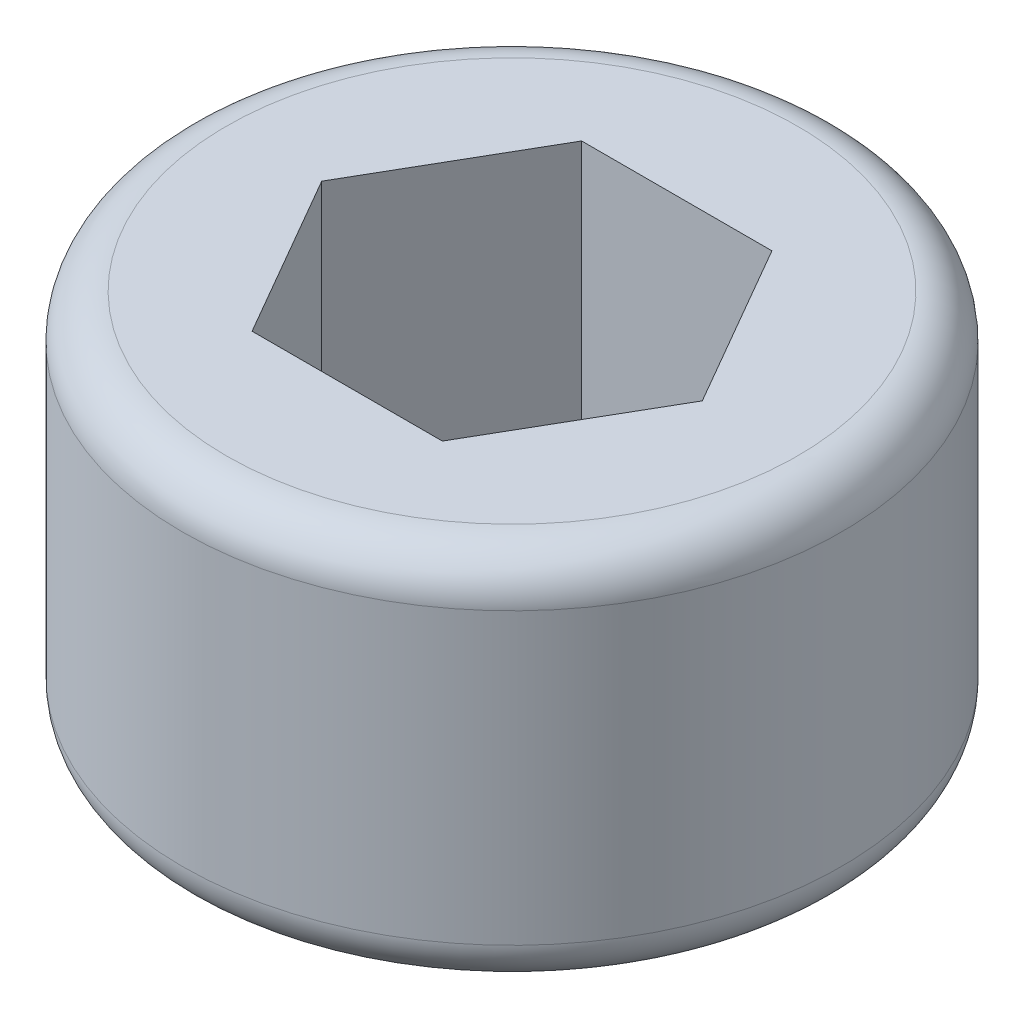
ISO-10303-21;
HEADER;
FILE_DESCRIPTION(('STEP AP214'),'2;1');
FILE_NAME('part.step','',(''),(''),'','','');
FILE_SCHEMA(('AUTOMOTIVE_DESIGN { 1 0 10303 214 1 1 1 1 }'));
ENDSEC;
DATA;
#1=APPLICATION_CONTEXT('core data for automotive mechanical design processes');
#2=APPLICATION_PROTOCOL_DEFINITION('international standard','automotive_design',2000,#1);
#3=PRODUCT_CONTEXT('',#1,'mechanical');
#4=PRODUCT('Part','Part','',(#3));
#5=PRODUCT_RELATED_PRODUCT_CATEGORY('part','',(#4));
#6=PRODUCT_DEFINITION_FORMATION('','',#4);
#7=PRODUCT_DEFINITION_CONTEXT('part definition',#1,'design');
#8=PRODUCT_DEFINITION('design','',#6,#7);
#9=PRODUCT_DEFINITION_SHAPE('','',#8);
#10=(LENGTH_UNIT() NAMED_UNIT(*) SI_UNIT(.MILLI.,.METRE.));
#11=(NAMED_UNIT(*) PLANE_ANGLE_UNIT() SI_UNIT($,.RADIAN.));
#12=(NAMED_UNIT(*) SI_UNIT($,.STERADIAN.) SOLID_ANGLE_UNIT());
#13=UNCERTAINTY_MEASURE_WITH_UNIT(LENGTH_MEASURE(1.E-05),#10,'distance_accuracy_value','');
#14=(GEOMETRIC_REPRESENTATION_CONTEXT(3) GLOBAL_UNCERTAINTY_ASSIGNED_CONTEXT((#13)) GLOBAL_UNIT_ASSIGNED_CONTEXT((#10,
#11,#12)) REPRESENTATION_CONTEXT('',''));
#15=CARTESIAN_POINT('',(0.,0.,0.));
#16=DIRECTION('',(0.,0.,1.));
#17=DIRECTION('',(1.,0.,0.));
#18=AXIS2_PLACEMENT_3D('',#15,#16,#17);
#19=CARTESIAN_POINT('',(0.,2.,0.));
#20=DIRECTION('',(0.,-1.,0.));
#21=DIRECTION('',(0.,0.,-1.));
#22=AXIS2_PLACEMENT_3D('',#19,#20,#21);
#23=CYLINDRICAL_SURFACE('',#22,1.5);
#24=CARTESIAN_POINT('',(0.,1.8,0.));
#25=DIRECTION('',(0.,1.,0.));
#26=DIRECTION('',(0.,0.,1.));
#27=AXIS2_PLACEMENT_3D('',#24,#25,#26);
#28=CIRCLE('',#27,1.5);
#29=CARTESIAN_POINT('',(0.,1.8,1.5));
#30=VERTEX_POINT('',#29);
#31=EDGE_CURVE('E43',#30,#30,#28,.F.);
#32=ORIENTED_EDGE('',*,*,#31,.T.);
#33=EDGE_LOOP('',(#32));
#34=FACE_BOUND('',#33,.T.);
#35=CARTESIAN_POINT('',(0.,0.481495457622373,0.));
#36=DIRECTION('',(0.,-1.,0.));
#37=DIRECTION('',(0.,0.,-1.));
#38=AXIS2_PLACEMENT_3D('',#35,#36,#37);
#39=CIRCLE('',#38,1.5);
#40=CARTESIAN_POINT('',(0.,0.481495457622373,-1.5));
#41=VERTEX_POINT('',#40);
#42=EDGE_CURVE('E146',#41,#41,#39,.F.);
#43=ORIENTED_EDGE('',*,*,#42,.T.);
#44=EDGE_LOOP('',(#43));
#45=FACE_BOUND('',#44,.T.);
#46=ADVANCED_FACE('F35',(#34,#45),#23,.T.);
#47=CARTESIAN_POINT('',(0.,2.,0.));
#48=DIRECTION('',(0.,1.,0.));
#49=DIRECTION('',(0.,0.,1.));
#50=AXIS2_PLACEMENT_3D('',#47,#48,#49);
#51=PLANE('',#50);
#52=CARTESIAN_POINT('',(0.,2.,0.));
#53=DIRECTION('',(0.,1.,0.));
#54=DIRECTION('',(0.,0.,1.));
#55=AXIS2_PLACEMENT_3D('',#52,#53,#54);
#56=CIRCLE('',#55,1.3);
#57=CARTESIAN_POINT('',(0.,2.,1.3));
#58=VERTEX_POINT('',#57);
#59=EDGE_CURVE('E138',#58,#58,#56,.T.);
#60=ORIENTED_EDGE('',*,*,#59,.T.);
#61=EDGE_LOOP('',(#60));
#62=FACE_BOUND('',#61,.T.);
#63=DIRECTION('',(0.5,0.,-0.866025403784439));
#64=VECTOR('',#63,1.);
#65=CARTESIAN_POINT('',(0.433012701892219,2.,0.75));
#66=LINE('',#65,#64);
#67=CARTESIAN_POINT('',(0.433012701892219,2.,0.75));
#68=VERTEX_POINT('',#67);
#69=CARTESIAN_POINT('',(0.866025403784439,2.,0.));
#70=VERTEX_POINT('',#69);
#71=EDGE_CURVE('E50',#68,#70,#66,.T.);
#72=ORIENTED_EDGE('',*,*,#71,.F.);
#73=DIRECTION('',(1.,0.,0.));
#74=VECTOR('',#73,1.);
#75=CARTESIAN_POINT('',(-0.43301270189222,2.,0.75));
#76=LINE('',#75,#74);
#77=CARTESIAN_POINT('',(-0.43301270189222,2.,0.75));
#78=VERTEX_POINT('',#77);
#79=EDGE_CURVE('E134',#78,#68,#76,.T.);
#80=ORIENTED_EDGE('',*,*,#79,.F.);
#81=DIRECTION('',(0.5,0.,0.866025403784439));
#82=VECTOR('',#81,1.);
#83=CARTESIAN_POINT('',(-0.866025403784439,2.,0.));
#84=LINE('',#83,#82);
#85=CARTESIAN_POINT('',(-0.866025403784439,2.,0.));
#86=VERTEX_POINT('',#85);
#87=EDGE_CURVE('E132',#86,#78,#84,.T.);
#88=ORIENTED_EDGE('',*,*,#87,.F.);
#89=DIRECTION('',(-0.5,0.,0.866025403784439));
#90=VECTOR('',#89,1.);
#91=CARTESIAN_POINT('',(-0.433012701892219,2.,-0.75));
#92=LINE('',#91,#90);
#93=CARTESIAN_POINT('',(-0.433012701892219,2.,-0.75));
#94=VERTEX_POINT('',#93);
#95=EDGE_CURVE('E98',#94,#86,#92,.T.);
#96=ORIENTED_EDGE('',*,*,#95,.F.);
#97=DIRECTION('',(-1.,0.,0.));
#98=VECTOR('',#97,1.);
#99=CARTESIAN_POINT('',(0.433012701892219,2.,-0.75));
#100=LINE('',#99,#98);
#101=CARTESIAN_POINT('',(0.433012701892219,2.,-0.75));
#102=VERTEX_POINT('',#101);
#103=EDGE_CURVE('E128',#102,#94,#100,.T.);
#104=ORIENTED_EDGE('',*,*,#103,.F.);
#105=DIRECTION('',(-0.5,0.,-0.866025403784439));
#106=VECTOR('',#105,1.);
#107=CARTESIAN_POINT('',(0.866025403784439,2.,0.));
#108=LINE('',#107,#106);
#109=EDGE_CURVE('E124',#70,#102,#108,.T.);
#110=ORIENTED_EDGE('',*,*,#109,.F.);
#111=EDGE_LOOP('',(#72,#80,#88,#96,#104,#110));
#112=FACE_BOUND('',#111,.T.);
#113=ADVANCED_FACE('F159',(#62,#112),#51,.T.);
#114=CARTESIAN_POINT('',(0.433012701892219,0.8,0.75));
#115=DIRECTION('',(0.866025403784439,0.,0.5));
#116=DIRECTION('',(0.5,0.,-0.866025403784439));
#117=AXIS2_PLACEMENT_3D('',#114,#115,#116);
#118=PLANE('',#117);
#119=ORIENTED_EDGE('',*,*,#71,.T.);
#120=DIRECTION('',(0.,1.,0.));
#121=VECTOR('',#120,1.);
#122=CARTESIAN_POINT('',(0.866025403784439,0.8,0.));
#123=LINE('',#122,#121);
#124=CARTESIAN_POINT('',(0.866025403784439,0.8,0.));
#125=VERTEX_POINT('',#124);
#126=EDGE_CURVE('E80',#125,#70,#123,.T.);
#127=ORIENTED_EDGE('',*,*,#126,.F.);
#128=DIRECTION('',(0.5,0.,-0.866025403784439));
#129=VECTOR('',#128,1.);
#130=CARTESIAN_POINT('',(0.433012701892219,0.8,0.75));
#131=LINE('',#130,#129);
#132=CARTESIAN_POINT('',(0.433012701892219,0.8,0.75));
#133=VERTEX_POINT('',#132);
#134=EDGE_CURVE('E136',#133,#125,#131,.T.);
#135=ORIENTED_EDGE('',*,*,#134,.F.);
#136=DIRECTION('',(0.,1.,0.));
#137=VECTOR('',#136,1.);
#138=CARTESIAN_POINT('',(0.433012701892219,0.8,0.75));
#139=LINE('',#138,#137);
#140=EDGE_CURVE('E58',#133,#68,#139,.T.);
#141=ORIENTED_EDGE('',*,*,#140,.T.);
#142=EDGE_LOOP('',(#119,#127,#135,#141));
#143=FACE_BOUND('',#142,.T.);
#144=ADVANCED_FACE('F162',(#143),#118,.F.);
#145=CARTESIAN_POINT('',(-0.43301270189222,0.8,0.75));
#146=DIRECTION('',(0.,0.,1.));
#147=DIRECTION('',(1.,0.,0.));
#148=AXIS2_PLACEMENT_3D('',#145,#146,#147);
#149=PLANE('',#148);
#150=ORIENTED_EDGE('',*,*,#79,.T.);
#151=ORIENTED_EDGE('',*,*,#140,.F.);
#152=DIRECTION('',(1.,0.,0.));
#153=VECTOR('',#152,1.);
#154=CARTESIAN_POINT('',(-0.43301270189222,0.8,0.75));
#155=LINE('',#154,#153);
#156=CARTESIAN_POINT('',(-0.43301270189222,0.8,0.75));
#157=VERTEX_POINT('',#156);
#158=EDGE_CURVE('E110',#157,#133,#155,.T.);
#159=ORIENTED_EDGE('',*,*,#158,.F.);
#160=DIRECTION('',(0.,1.,0.));
#161=VECTOR('',#160,1.);
#162=CARTESIAN_POINT('',(-0.43301270189222,0.8,0.75));
#163=LINE('',#162,#161);
#164=EDGE_CURVE('E102',#157,#78,#163,.T.);
#165=ORIENTED_EDGE('',*,*,#164,.T.);
#166=EDGE_LOOP('',(#150,#151,#159,#165));
#167=FACE_BOUND('',#166,.T.);
#168=ADVANCED_FACE('F198',(#167),#149,.F.);
#169=CARTESIAN_POINT('',(-0.866025403784439,0.8,0.));
#170=DIRECTION('',(-0.866025403784439,0.,0.5));
#171=DIRECTION('',(0.5,0.,0.866025403784439));
#172=AXIS2_PLACEMENT_3D('',#169,#170,#171);
#173=PLANE('',#172);
#174=ORIENTED_EDGE('',*,*,#87,.T.);
#175=ORIENTED_EDGE('',*,*,#164,.F.);
#176=DIRECTION('',(0.5,0.,0.866025403784439));
#177=VECTOR('',#176,1.);
#178=CARTESIAN_POINT('',(-0.866025403784439,0.8,0.));
#179=LINE('',#178,#177);
#180=CARTESIAN_POINT('',(-0.866025403784439,0.8,0.));
#181=VERTEX_POINT('',#180);
#182=EDGE_CURVE('E106',#181,#157,#179,.T.);
#183=ORIENTED_EDGE('',*,*,#182,.F.);
#184=DIRECTION('',(0.,1.,0.));
#185=VECTOR('',#184,1.);
#186=CARTESIAN_POINT('',(-0.866025403784439,0.8,0.));
#187=LINE('',#186,#185);
#188=EDGE_CURVE('E91',#181,#86,#187,.T.);
#189=ORIENTED_EDGE('',*,*,#188,.T.);
#190=EDGE_LOOP('',(#174,#175,#183,#189));
#191=FACE_BOUND('',#190,.T.);
#192=ADVANCED_FACE('F107',(#191),#173,.F.);
#193=CARTESIAN_POINT('',(-0.433012701892219,0.8,-0.75));
#194=DIRECTION('',(-0.866025403784439,0.,-0.5));
#195=DIRECTION('',(-0.5,0.,0.866025403784439));
#196=AXIS2_PLACEMENT_3D('',#193,#194,#195);
#197=PLANE('',#196);
#198=ORIENTED_EDGE('',*,*,#95,.T.);
#199=ORIENTED_EDGE('',*,*,#188,.F.);
#200=DIRECTION('',(-0.5,0.,0.866025403784439));
#201=VECTOR('',#200,1.);
#202=CARTESIAN_POINT('',(-0.433012701892219,0.8,-0.75));
#203=LINE('',#202,#201);
#204=CARTESIAN_POINT('',(-0.433012701892219,0.8,-0.75));
#205=VERTEX_POINT('',#204);
#206=EDGE_CURVE('E95',#205,#181,#203,.T.);
#207=ORIENTED_EDGE('',*,*,#206,.F.);
#208=DIRECTION('',(0.,1.,0.));
#209=VECTOR('',#208,1.);
#210=CARTESIAN_POINT('',(-0.433012701892219,0.8,-0.75));
#211=LINE('',#210,#209);
#212=EDGE_CURVE('E103',#205,#94,#211,.T.);
#213=ORIENTED_EDGE('',*,*,#212,.T.);
#214=EDGE_LOOP('',(#198,#199,#207,#213));
#215=FACE_BOUND('',#214,.T.);
#216=ADVANCED_FACE('F93',(#215),#197,.F.);
#217=CARTESIAN_POINT('',(0.433012701892219,0.8,-0.75));
#218=DIRECTION('',(0.,0.,-1.));
#219=DIRECTION('',(-1.,0.,0.));
#220=AXIS2_PLACEMENT_3D('',#217,#218,#219);
#221=PLANE('',#220);
#222=ORIENTED_EDGE('',*,*,#103,.T.);
#223=ORIENTED_EDGE('',*,*,#212,.F.);
#224=DIRECTION('',(-1.,0.,0.));
#225=VECTOR('',#224,1.);
#226=CARTESIAN_POINT('',(0.433012701892219,0.8,-0.75));
#227=LINE('',#226,#225);
#228=CARTESIAN_POINT('',(0.433012701892219,0.8,-0.75));
#229=VERTEX_POINT('',#228);
#230=EDGE_CURVE('E116',#229,#205,#227,.T.);
#231=ORIENTED_EDGE('',*,*,#230,.F.);
#232=DIRECTION('',(0.,1.,0.));
#233=VECTOR('',#232,1.);
#234=CARTESIAN_POINT('',(0.433012701892219,0.8,-0.75));
#235=LINE('',#234,#233);
#236=EDGE_CURVE('E141',#229,#102,#235,.T.);
#237=ORIENTED_EDGE('',*,*,#236,.T.);
#238=EDGE_LOOP('',(#222,#223,#231,#237));
#239=FACE_BOUND('',#238,.T.);
#240=ADVANCED_FACE('F217',(#239),#221,.F.);
#241=CARTESIAN_POINT('',(0.866025403784439,0.8,0.));
#242=DIRECTION('',(0.866025403784439,0.,-0.5));
#243=DIRECTION('',(-0.5,0.,-0.866025403784439));
#244=AXIS2_PLACEMENT_3D('',#241,#242,#243);
#245=PLANE('',#244);
#246=ORIENTED_EDGE('',*,*,#109,.T.);
#247=ORIENTED_EDGE('',*,*,#236,.F.);
#248=DIRECTION('',(-0.5,0.,-0.866025403784439));
#249=VECTOR('',#248,1.);
#250=CARTESIAN_POINT('',(0.866025403784439,0.8,0.));
#251=LINE('',#250,#249);
#252=EDGE_CURVE('E118',#125,#229,#251,.T.);
#253=ORIENTED_EDGE('',*,*,#252,.F.);
#254=ORIENTED_EDGE('',*,*,#126,.T.);
#255=EDGE_LOOP('',(#246,#247,#253,#254));
#256=FACE_BOUND('',#255,.T.);
#257=ADVANCED_FACE('F168',(#256),#245,.F.);
#258=CARTESIAN_POINT('',(0.,0.8,0.));
#259=DIRECTION('',(0.,1.,0.));
#260=DIRECTION('',(0.,0.,1.));
#261=AXIS2_PLACEMENT_3D('',#258,#259,#260);
#262=PLANE('',#261);
#263=ORIENTED_EDGE('',*,*,#134,.T.);
#264=ORIENTED_EDGE('',*,*,#252,.T.);
#265=ORIENTED_EDGE('',*,*,#230,.T.);
#266=ORIENTED_EDGE('',*,*,#206,.T.);
#267=ORIENTED_EDGE('',*,*,#182,.T.);
#268=ORIENTED_EDGE('',*,*,#158,.T.);
#269=EDGE_LOOP('',(#263,#264,#265,#266,#267,#268));
#270=FACE_BOUND('',#269,.T.);
#271=ADVANCED_FACE('F113',(#270),#262,.T.);
#272=CARTESIAN_POINT('',(0.,0.,0.));
#273=DIRECTION('',(0.,1.,0.));
#274=DIRECTION('',(0.,0.,1.));
#275=AXIS2_PLACEMENT_3D('',#272,#273,#274);
#276=CONICAL_SURFACE('',#275,0.866025403784429,1.04719755119659);
#277=CARTESIAN_POINT('',(0.,0.308290376865486,0.));
#278=DIRECTION('',(0.,-1.,0.));
#279=DIRECTION('',(0.,0.,-1.));
#280=AXIS2_PLACEMENT_3D('',#277,#278,#279);
#281=CIRCLE('',#280,1.4);
#282=CARTESIAN_POINT('',(0.,0.308290376865486,-1.4));
#283=VERTEX_POINT('',#282);
#284=EDGE_CURVE('E11',#283,#283,#281,.T.);
#285=ORIENTED_EDGE('',*,*,#284,.T.);
#286=EDGE_LOOP('',(#285));
#287=FACE_BOUND('',#286,.T.);
#288=CARTESIAN_POINT('',(0.,0.,0.));
#289=DIRECTION('',(0.,1.,0.));
#290=DIRECTION('',(0.,0.,1.));
#291=AXIS2_PLACEMENT_3D('',#288,#289,#290);
#292=CIRCLE('',#291,0.866025403784429);
#293=CARTESIAN_POINT('',(0.,0.,0.866025403784429));
#294=VERTEX_POINT('',#293);
#295=EDGE_CURVE('E125',#294,#294,#292,.T.);
#296=ORIENTED_EDGE('',*,*,#295,.T.);
#297=EDGE_LOOP('',(#296));
#298=FACE_BOUND('',#297,.T.);
#299=ADVANCED_FACE('F174',(#287,#298),#276,.T.);
#300=CARTESIAN_POINT('',(0.,0.,0.));
#301=DIRECTION('',(0.,1.,0.));
#302=DIRECTION('',(0.,0.,1.));
#303=AXIS2_PLACEMENT_3D('',#300,#301,#302);
#304=PLANE('',#303);
#305=ORIENTED_EDGE('',*,*,#295,.F.);
#306=EDGE_LOOP('',(#305));
#307=FACE_BOUND('',#306,.T.);
#308=ADVANCED_FACE('F156',(#307),#304,.F.);
#309=CARTESIAN_POINT('',(0.,1.8,0.));
#310=DIRECTION('',(0.,1.,0.));
#311=DIRECTION('',(0.,0.,1.));
#312=AXIS2_PLACEMENT_3D('',#309,#310,#311);
#313=TOROIDAL_SURFACE('',#312,1.3,0.2);
#314=ORIENTED_EDGE('',*,*,#31,.F.);
#315=EDGE_LOOP('',(#314));
#316=FACE_BOUND('',#315,.T.);
#317=ORIENTED_EDGE('',*,*,#59,.F.);
#318=EDGE_LOOP('',(#317));
#319=FACE_BOUND('',#318,.T.);
#320=ADVANCED_FACE('F153',(#316,#319),#313,.T.);
#321=CARTESIAN_POINT('',(0.,0.481495457622373,0.));
#322=DIRECTION('',(0.,-1.,0.));
#323=DIRECTION('',(0.,0.,-1.));
#324=AXIS2_PLACEMENT_3D('',#321,#322,#323);
#325=TOROIDAL_SURFACE('',#324,1.3,0.2);
#326=ORIENTED_EDGE('',*,*,#284,.F.);
#327=EDGE_LOOP('',(#326));
#328=FACE_BOUND('',#327,.T.);
#329=ORIENTED_EDGE('',*,*,#42,.F.);
#330=EDGE_LOOP('',(#329));
#331=FACE_BOUND('',#330,.T.);
#332=ADVANCED_FACE('F37',(#328,#331),#325,.T.);
#333=CLOSED_SHELL('',(#46,#113,#144,#168,#192,#216,#240,#257,#271,#299,#308,#320,#332));
#334=MANIFOLD_SOLID_BREP('B2',#333);
#335=ADVANCED_BREP_SHAPE_REPRESENTATION('',(#18,#334),#14);
#336=SHAPE_DEFINITION_REPRESENTATION(#9,#335);
ENDSEC;
END-ISO-10303-21;
